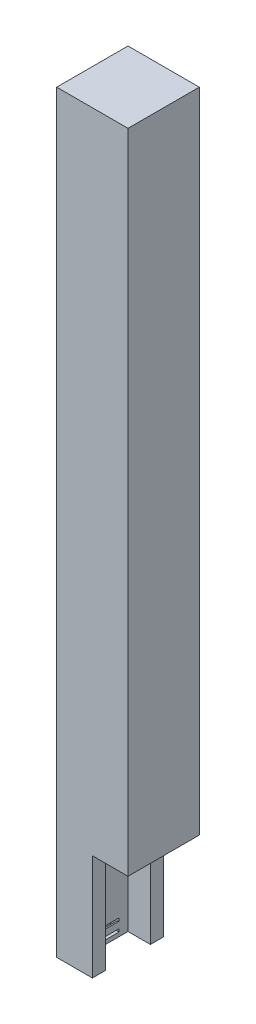
ISO-10303-21;
HEADER;
FILE_DESCRIPTION(('STEP AP214'),'2;1');
FILE_NAME('part.step','',(''),(''),'','','');
FILE_SCHEMA(('AUTOMOTIVE_DESIGN { 1 0 10303 214 1 1 1 1 }'));
ENDSEC;
DATA;
#1=APPLICATION_CONTEXT('core data for automotive mechanical design processes');
#2=APPLICATION_PROTOCOL_DEFINITION('international standard','automotive_design',2000,#1);
#3=PRODUCT_CONTEXT('',#1,'mechanical');
#4=PRODUCT('Part','Part','',(#3));
#5=PRODUCT_RELATED_PRODUCT_CATEGORY('part','',(#4));
#6=PRODUCT_DEFINITION_FORMATION('','',#4);
#7=PRODUCT_DEFINITION_CONTEXT('part definition',#1,'design');
#8=PRODUCT_DEFINITION('design','',#6,#7);
#9=PRODUCT_DEFINITION_SHAPE('','',#8);
#10=(LENGTH_UNIT() NAMED_UNIT(*) SI_UNIT(.MILLI.,.METRE.));
#11=(NAMED_UNIT(*) PLANE_ANGLE_UNIT() SI_UNIT($,.RADIAN.));
#12=(NAMED_UNIT(*) SI_UNIT($,.STERADIAN.) SOLID_ANGLE_UNIT());
#13=UNCERTAINTY_MEASURE_WITH_UNIT(LENGTH_MEASURE(1.E-05),#10,'distance_accuracy_value','');
#14=(GEOMETRIC_REPRESENTATION_CONTEXT(3) GLOBAL_UNCERTAINTY_ASSIGNED_CONTEXT((#13)) GLOBAL_UNIT_ASSIGNED_CONTEXT((#10,
#11,#12)) REPRESENTATION_CONTEXT('',''));
#15=CARTESIAN_POINT('',(0.,0.,0.));
#16=DIRECTION('',(0.,0.,1.));
#17=DIRECTION('',(1.,0.,0.));
#18=AXIS2_PLACEMENT_3D('',#15,#16,#17);
#19=CARTESIAN_POINT('',(-9.525,5.08,-4.191));
#20=DIRECTION('',(0.,0.,-1.));
#21=DIRECTION('',(-1.,0.,0.));
#22=AXIS2_PLACEMENT_3D('',#19,#20,#21);
#23=PLANE('',#22);
#24=CARTESIAN_POINT('',(-6.985,3.175,-4.191));
#25=DIRECTION('',(0.,0.,-1.));
#26=DIRECTION('',(-1.,0.,0.));
#27=AXIS2_PLACEMENT_3D('',#24,#25,#26);
#28=CIRCLE('',#27,1.016);
#29=CARTESIAN_POINT('',(-6.985,2.159,-4.191));
#30=VERTEX_POINT('',#29);
#31=CARTESIAN_POINT('',(-6.985,4.191,-4.191));
#32=VERTEX_POINT('',#31);
#33=EDGE_CURVE('E319',#30,#32,#28,.T.);
#34=ORIENTED_EDGE('',*,*,#33,.T.);
#35=DIRECTION('',(0.,1.,0.));
#36=VECTOR('',#35,1.);
#37=CARTESIAN_POINT('',(-6.985,5.08,-4.191));
#38=LINE('',#37,#36);
#39=CARTESIAN_POINT('',(-6.985,5.08,-4.191));
#40=VERTEX_POINT('',#39);
#41=EDGE_CURVE('E322',#32,#40,#38,.T.);
#42=ORIENTED_EDGE('',*,*,#41,.T.);
#43=DIRECTION('',(1.,0.,0.));
#44=VECTOR('',#43,1.);
#45=CARTESIAN_POINT('',(-9.525,5.08,-4.191));
#46=LINE('',#45,#44);
#47=CARTESIAN_POINT('',(-9.525,5.08,-4.191));
#48=VERTEX_POINT('',#47);
#49=EDGE_CURVE('E346',#48,#40,#46,.T.);
#50=ORIENTED_EDGE('',*,*,#49,.F.);
#51=DIRECTION('',(0.,1.,0.));
#52=VECTOR('',#51,1.);
#53=CARTESIAN_POINT('',(-9.525,5.08,-4.191));
#54=LINE('',#53,#52);
#55=CARTESIAN_POINT('',(-9.525,1.27,-4.191));
#56=VERTEX_POINT('',#55);
#57=EDGE_CURVE('E329',#56,#48,#54,.T.);
#58=ORIENTED_EDGE('',*,*,#57,.F.);
#59=DIRECTION('',(1.,0.,0.));
#60=VECTOR('',#59,1.);
#61=CARTESIAN_POINT('',(-9.525,1.27,-4.191));
#62=LINE('',#61,#60);
#63=CARTESIAN_POINT('',(-6.985,1.27,-4.191));
#64=VERTEX_POINT('',#63);
#65=EDGE_CURVE('E360',#56,#64,#62,.T.);
#66=ORIENTED_EDGE('',*,*,#65,.T.);
#67=EDGE_CURVE('E68',#64,#30,#38,.T.);
#68=ORIENTED_EDGE('',*,*,#67,.T.);
#69=EDGE_LOOP('',(#34,#42,#50,#58,#66,#68));
#70=FACE_BOUND('',#69,.T.);
#71=ADVANCED_FACE('F45',(#70),#23,.F.);
#72=CARTESIAN_POINT('',(-9.525,5.08,4.191));
#73=DIRECTION('',(0.,0.,1.));
#74=DIRECTION('',(1.,0.,0.));
#75=AXIS2_PLACEMENT_3D('',#72,#73,#74);
#76=PLANE('',#75);
#77=CARTESIAN_POINT('',(-6.985,3.175,4.191));
#78=DIRECTION('',(0.,0.,-1.));
#79=DIRECTION('',(-1.,0.,0.));
#80=AXIS2_PLACEMENT_3D('',#77,#78,#79);
#81=CIRCLE('',#80,1.016);
#82=CARTESIAN_POINT('',(-6.985,2.159,4.191));
#83=VERTEX_POINT('',#82);
#84=CARTESIAN_POINT('',(-6.985,4.191,4.191));
#85=VERTEX_POINT('',#84);
#86=EDGE_CURVE('E314',#83,#85,#81,.T.);
#87=ORIENTED_EDGE('',*,*,#86,.F.);
#88=DIRECTION('',(0.,-1.,0.));
#89=VECTOR('',#88,1.);
#90=CARTESIAN_POINT('',(-6.985,5.08,4.191));
#91=LINE('',#90,#89);
#92=CARTESIAN_POINT('',(-6.985,1.27,4.191));
#93=VERTEX_POINT('',#92);
#94=EDGE_CURVE('E353',#83,#93,#91,.T.);
#95=ORIENTED_EDGE('',*,*,#94,.T.);
#96=DIRECTION('',(1.,0.,0.));
#97=VECTOR('',#96,1.);
#98=CARTESIAN_POINT('',(-9.525,1.27,4.191));
#99=LINE('',#98,#97);
#100=CARTESIAN_POINT('',(-9.525,1.27,4.191));
#101=VERTEX_POINT('',#100);
#102=EDGE_CURVE('E364',#101,#93,#99,.T.);
#103=ORIENTED_EDGE('',*,*,#102,.F.);
#104=DIRECTION('',(0.,-1.,0.));
#105=VECTOR('',#104,1.);
#106=CARTESIAN_POINT('',(-9.525,5.08,4.191));
#107=LINE('',#106,#105);
#108=CARTESIAN_POINT('',(-9.525,5.08,4.191));
#109=VERTEX_POINT('',#108);
#110=EDGE_CURVE('E338',#109,#101,#107,.T.);
#111=ORIENTED_EDGE('',*,*,#110,.F.);
#112=DIRECTION('',(1.,0.,0.));
#113=VECTOR('',#112,1.);
#114=CARTESIAN_POINT('',(-9.525,5.08,4.191));
#115=LINE('',#114,#113);
#116=CARTESIAN_POINT('',(-6.985,5.08,4.191));
#117=VERTEX_POINT('',#116);
#118=EDGE_CURVE('E368',#109,#117,#115,.T.);
#119=ORIENTED_EDGE('',*,*,#118,.T.);
#120=EDGE_CURVE('E354',#117,#85,#91,.T.);
#121=ORIENTED_EDGE('',*,*,#120,.T.);
#122=EDGE_LOOP('',(#87,#95,#103,#111,#119,#121));
#123=FACE_BOUND('',#122,.T.);
#124=ADVANCED_FACE('F409',(#123),#76,.F.);
#125=CARTESIAN_POINT('',(0.,0.,0.));
#126=DIRECTION('',(0.,-1.,0.));
#127=DIRECTION('',(0.,0.,-1.));
#128=AXIS2_PLACEMENT_3D('',#125,#126,#127);
#129=PLANE('',#128);
#130=DIRECTION('',(0.,0.,-1.));
#131=VECTOR('',#130,1.);
#132=CARTESIAN_POINT('',(0.,0.,11.1125));
#133=LINE('',#132,#131);
#134=CARTESIAN_POINT('',(0.,0.,11.1125));
#135=VERTEX_POINT('',#134);
#136=CARTESIAN_POINT('',(0.,0.,6.985));
#137=VERTEX_POINT('',#136);
#138=EDGE_CURVE('E180',#135,#137,#133,.T.);
#139=ORIENTED_EDGE('',*,*,#138,.F.);
#140=DIRECTION('',(1.,0.,0.));
#141=VECTOR('',#140,1.);
#142=CARTESIAN_POINT('',(-11.1125,0.,11.1125));
#143=LINE('',#142,#141);
#144=CARTESIAN_POINT('',(-11.1125,0.,11.1125));
#145=VERTEX_POINT('',#144);
#146=EDGE_CURVE('E197',#145,#135,#143,.T.);
#147=ORIENTED_EDGE('',*,*,#146,.F.);
#148=DIRECTION('',(0.,0.,1.));
#149=VECTOR('',#148,1.);
#150=CARTESIAN_POINT('',(-11.1125,0.,11.1125));
#151=LINE('',#150,#149);
#152=CARTESIAN_POINT('',(-11.1125,0.,-11.1125));
#153=VERTEX_POINT('',#152);
#154=EDGE_CURVE('E204',#153,#145,#151,.T.);
#155=ORIENTED_EDGE('',*,*,#154,.F.);
#156=DIRECTION('',(-1.,0.,0.));
#157=VECTOR('',#156,1.);
#158=CARTESIAN_POINT('',(-11.1125,0.,-11.1125));
#159=LINE('',#158,#157);
#160=CARTESIAN_POINT('',(0.,0.,-11.1125));
#161=VERTEX_POINT('',#160);
#162=EDGE_CURVE('E255',#161,#153,#159,.T.);
#163=ORIENTED_EDGE('',*,*,#162,.F.);
#164=CARTESIAN_POINT('',(0.,0.,-6.985));
#165=VERTEX_POINT('',#164);
#166=EDGE_CURVE('E273',#165,#161,#133,.T.);
#167=ORIENTED_EDGE('',*,*,#166,.F.);
#168=DIRECTION('',(-1.,0.,0.));
#169=VECTOR('',#168,1.);
#170=CARTESIAN_POINT('',(-6.985,0.,-6.985));
#171=LINE('',#170,#169);
#172=CARTESIAN_POINT('',(-6.985,0.,-6.985));
#173=VERTEX_POINT('',#172);
#174=EDGE_CURVE('E363',#165,#173,#171,.T.);
#175=ORIENTED_EDGE('',*,*,#174,.T.);
#176=DIRECTION('',(0.,0.,1.));
#177=VECTOR('',#176,1.);
#178=CARTESIAN_POINT('',(-6.985,0.,6.985));
#179=LINE('',#178,#177);
#180=CARTESIAN_POINT('',(-6.985,0.,6.985));
#181=VERTEX_POINT('',#180);
#182=EDGE_CURVE('E246',#173,#181,#179,.T.);
#183=ORIENTED_EDGE('',*,*,#182,.T.);
#184=DIRECTION('',(1.,0.,0.));
#185=VECTOR('',#184,1.);
#186=CARTESIAN_POINT('',(-6.985,0.,6.985));
#187=LINE('',#186,#185);
#188=EDGE_CURVE('E239',#181,#137,#187,.T.);
#189=ORIENTED_EDGE('',*,*,#188,.T.);
#190=EDGE_LOOP('',(#139,#147,#155,#163,#167,#175,#183,#189));
#191=FACE_BOUND('',#190,.T.);
#192=ADVANCED_FACE('F268',(#191),#129,.T.);
#193=CARTESIAN_POINT('',(11.1125,6.35,11.1125));
#194=DIRECTION('',(-1.,0.,0.));
#195=DIRECTION('',(0.,0.,1.));
#196=AXIS2_PLACEMENT_3D('',#193,#194,#195);
#197=PLANE('',#196);
#198=DIRECTION('',(0.,-1.,0.));
#199=VECTOR('',#198,1.);
#200=CARTESIAN_POINT('',(11.1125,6.35,11.1125));
#201=LINE('',#200,#199);
#202=CARTESIAN_POINT('',(11.1125,234.95,11.1125));
#203=VERTEX_POINT('',#202);
#204=CARTESIAN_POINT('',(11.1125,33.02,11.1125));
#205=VERTEX_POINT('',#204);
#206=EDGE_CURVE('E186',#203,#205,#201,.T.);
#207=ORIENTED_EDGE('',*,*,#206,.T.);
#208=DIRECTION('',(0.,0.,1.));
#209=VECTOR('',#208,1.);
#210=CARTESIAN_POINT('',(11.1125,33.02,11.1125));
#211=LINE('',#210,#209);
#212=CARTESIAN_POINT('',(11.1125,33.02,-11.1125));
#213=VERTEX_POINT('',#212);
#214=EDGE_CURVE('E169',#213,#205,#211,.T.);
#215=ORIENTED_EDGE('',*,*,#214,.F.);
#216=DIRECTION('',(0.,-1.,0.));
#217=VECTOR('',#216,1.);
#218=CARTESIAN_POINT('',(11.1125,6.35,-11.1125));
#219=LINE('',#218,#217);
#220=CARTESIAN_POINT('',(11.1125,234.95,-11.1125));
#221=VERTEX_POINT('',#220);
#222=EDGE_CURVE('E211',#221,#213,#219,.T.);
#223=ORIENTED_EDGE('',*,*,#222,.F.);
#224=DIRECTION('',(0.,0.,-1.));
#225=VECTOR('',#224,1.);
#226=CARTESIAN_POINT('',(11.1125,234.95,11.1125));
#227=LINE('',#226,#225);
#228=EDGE_CURVE('E194',#203,#221,#227,.T.);
#229=ORIENTED_EDGE('',*,*,#228,.F.);
#230=EDGE_LOOP('',(#207,#215,#223,#229));
#231=FACE_BOUND('',#230,.T.);
#232=ADVANCED_FACE('F47',(#231),#197,.F.);
#233=CARTESIAN_POINT('',(-11.1125,6.35,-11.1125));
#234=DIRECTION('',(0.,0.,1.));
#235=DIRECTION('',(1.,0.,0.));
#236=AXIS2_PLACEMENT_3D('',#233,#234,#235);
#237=PLANE('',#236);
#238=DIRECTION('',(1.,0.,0.));
#239=VECTOR('',#238,1.);
#240=CARTESIAN_POINT('',(11.1125,33.02,-11.1125));
#241=LINE('',#240,#239);
#242=CARTESIAN_POINT('',(0.,33.02,-11.1125));
#243=VERTEX_POINT('',#242);
#244=EDGE_CURVE('E175',#243,#213,#241,.T.);
#245=ORIENTED_EDGE('',*,*,#244,.F.);
#246=DIRECTION('',(0.,-1.,0.));
#247=VECTOR('',#246,1.);
#248=CARTESIAN_POINT('',(0.,33.02,-11.1125));
#249=LINE('',#248,#247);
#250=EDGE_CURVE('E232',#243,#161,#249,.T.);
#251=ORIENTED_EDGE('',*,*,#250,.T.);
#252=ORIENTED_EDGE('',*,*,#162,.T.);
#253=DIRECTION('',(0.,-1.,0.));
#254=VECTOR('',#253,1.);
#255=CARTESIAN_POINT('',(-11.1125,6.35,-11.1125));
#256=LINE('',#255,#254);
#257=CARTESIAN_POINT('',(-11.1125,234.95,-11.1125));
#258=VERTEX_POINT('',#257);
#259=EDGE_CURVE('E202',#258,#153,#256,.T.);
#260=ORIENTED_EDGE('',*,*,#259,.F.);
#261=DIRECTION('',(-1.,0.,0.));
#262=VECTOR('',#261,1.);
#263=CARTESIAN_POINT('',(-11.1125,234.95,-11.1125));
#264=LINE('',#263,#262);
#265=EDGE_CURVE('E291',#221,#258,#264,.T.);
#266=ORIENTED_EDGE('',*,*,#265,.F.);
#267=ORIENTED_EDGE('',*,*,#222,.T.);
#268=EDGE_LOOP('',(#245,#251,#252,#260,#266,#267));
#269=FACE_BOUND('',#268,.T.);
#270=ADVANCED_FACE('F392',(#269),#237,.F.);
#271=CARTESIAN_POINT('',(-11.1125,6.35,11.1125));
#272=DIRECTION('',(1.,0.,0.));
#273=DIRECTION('',(0.,0.,-1.));
#274=AXIS2_PLACEMENT_3D('',#271,#272,#273);
#275=PLANE('',#274);
#276=ORIENTED_EDGE('',*,*,#154,.T.);
#277=DIRECTION('',(0.,-1.,0.));
#278=VECTOR('',#277,1.);
#279=CARTESIAN_POINT('',(-11.1125,6.35,11.1125));
#280=LINE('',#279,#278);
#281=CARTESIAN_POINT('',(-11.1125,234.95,11.1125));
#282=VERTEX_POINT('',#281);
#283=EDGE_CURVE('E196',#282,#145,#280,.T.);
#284=ORIENTED_EDGE('',*,*,#283,.F.);
#285=DIRECTION('',(0.,0.,1.));
#286=VECTOR('',#285,1.);
#287=CARTESIAN_POINT('',(-11.1125,234.95,11.1125));
#288=LINE('',#287,#286);
#289=EDGE_CURVE('E295',#258,#282,#288,.T.);
#290=ORIENTED_EDGE('',*,*,#289,.F.);
#291=ORIENTED_EDGE('',*,*,#259,.T.);
#292=EDGE_LOOP('',(#276,#284,#290,#291));
#293=FACE_BOUND('',#292,.T.);
#294=ADVANCED_FACE('F260',(#293),#275,.F.);
#295=CARTESIAN_POINT('',(-11.1125,6.35,11.1125));
#296=DIRECTION('',(0.,0.,-1.));
#297=DIRECTION('',(-1.,0.,0.));
#298=AXIS2_PLACEMENT_3D('',#295,#296,#297);
#299=PLANE('',#298);
#300=ORIENTED_EDGE('',*,*,#146,.T.);
#301=DIRECTION('',(0.,-1.,0.));
#302=VECTOR('',#301,1.);
#303=CARTESIAN_POINT('',(0.,33.02,11.1125));
#304=LINE('',#303,#302);
#305=CARTESIAN_POINT('',(0.,33.02,11.1125));
#306=VERTEX_POINT('',#305);
#307=EDGE_CURVE('E188',#306,#135,#304,.T.);
#308=ORIENTED_EDGE('',*,*,#307,.F.);
#309=DIRECTION('',(-1.,0.,0.));
#310=VECTOR('',#309,1.);
#311=CARTESIAN_POINT('',(11.1125,33.02,11.1125));
#312=LINE('',#311,#310);
#313=EDGE_CURVE('E172',#205,#306,#312,.T.);
#314=ORIENTED_EDGE('',*,*,#313,.F.);
#315=ORIENTED_EDGE('',*,*,#206,.F.);
#316=DIRECTION('',(1.,0.,0.));
#317=VECTOR('',#316,1.);
#318=CARTESIAN_POINT('',(-11.1125,234.95,11.1125));
#319=LINE('',#318,#317);
#320=EDGE_CURVE('E266',#282,#203,#319,.T.);
#321=ORIENTED_EDGE('',*,*,#320,.F.);
#322=ORIENTED_EDGE('',*,*,#283,.T.);
#323=EDGE_LOOP('',(#300,#308,#314,#315,#321,#322));
#324=FACE_BOUND('',#323,.T.);
#325=ADVANCED_FACE('F184',(#324),#299,.F.);
#326=CARTESIAN_POINT('',(6.985,6.35,6.985));
#327=DIRECTION('',(-1.,0.,0.));
#328=DIRECTION('',(0.,0.,1.));
#329=AXIS2_PLACEMENT_3D('',#326,#327,#328);
#330=PLANE('',#329);
#331=DIRECTION('',(0.,0.,-1.));
#332=VECTOR('',#331,1.);
#333=CARTESIAN_POINT('',(6.985,33.02,6.985));
#334=LINE('',#333,#332);
#335=CARTESIAN_POINT('',(6.985,33.02,6.985));
#336=VERTEX_POINT('',#335);
#337=CARTESIAN_POINT('',(6.985,33.02,-6.985));
#338=VERTEX_POINT('',#337);
#339=EDGE_CURVE('E216',#336,#338,#334,.T.);
#340=ORIENTED_EDGE('',*,*,#339,.F.);
#341=DIRECTION('',(0.,-1.,0.));
#342=VECTOR('',#341,1.);
#343=CARTESIAN_POINT('',(6.985,6.35,6.985));
#344=LINE('',#343,#342);
#345=CARTESIAN_POINT('',(6.985,228.6,6.985));
#346=VERTEX_POINT('',#345);
#347=EDGE_CURVE('E226',#346,#336,#344,.T.);
#348=ORIENTED_EDGE('',*,*,#347,.F.);
#349=DIRECTION('',(0.,0.,-1.));
#350=VECTOR('',#349,1.);
#351=CARTESIAN_POINT('',(6.985,228.6,6.985));
#352=LINE('',#351,#350);
#353=CARTESIAN_POINT('',(6.985,228.6,-6.98499999999999));
#354=VERTEX_POINT('',#353);
#355=EDGE_CURVE('E300',#346,#354,#352,.T.);
#356=ORIENTED_EDGE('',*,*,#355,.T.);
#357=DIRECTION('',(0.,-1.,0.));
#358=VECTOR('',#357,1.);
#359=CARTESIAN_POINT('',(6.985,6.35,-6.985));
#360=LINE('',#359,#358);
#361=EDGE_CURVE('E229',#354,#338,#360,.T.);
#362=ORIENTED_EDGE('',*,*,#361,.T.);
#363=EDGE_LOOP('',(#340,#348,#356,#362));
#364=FACE_BOUND('',#363,.T.);
#365=ADVANCED_FACE('F224',(#364),#330,.T.);
#366=CARTESIAN_POINT('',(-6.985,6.35,-6.985));
#367=DIRECTION('',(0.,0.,1.));
#368=DIRECTION('',(1.,0.,0.));
#369=AXIS2_PLACEMENT_3D('',#366,#367,#368);
#370=PLANE('',#369);
#371=DIRECTION('',(0.,-1.,0.));
#372=VECTOR('',#371,1.);
#373=CARTESIAN_POINT('',(0.,6.35,-6.985));
#374=LINE('',#373,#372);
#375=CARTESIAN_POINT('',(0.,33.02,-6.985));
#376=VERTEX_POINT('',#375);
#377=EDGE_CURVE('E286',#376,#165,#374,.T.);
#378=ORIENTED_EDGE('',*,*,#377,.F.);
#379=DIRECTION('',(-1.,0.,0.));
#380=VECTOR('',#379,1.);
#381=CARTESIAN_POINT('',(-6.985,33.02,-6.985));
#382=LINE('',#381,#380);
#383=EDGE_CURVE('E231',#338,#376,#382,.T.);
#384=ORIENTED_EDGE('',*,*,#383,.F.);
#385=ORIENTED_EDGE('',*,*,#361,.F.);
#386=DIRECTION('',(-1.,0.,0.));
#387=VECTOR('',#386,1.);
#388=CARTESIAN_POINT('',(-6.98499999999999,228.6,-6.98499999999999));
#389=LINE('',#388,#387);
#390=CARTESIAN_POINT('',(-6.98499999999999,228.6,-6.98499999999999));
#391=VERTEX_POINT('',#390);
#392=EDGE_CURVE('E303',#354,#391,#389,.T.);
#393=ORIENTED_EDGE('',*,*,#392,.T.);
#394=DIRECTION('',(0.,-1.,0.));
#395=VECTOR('',#394,1.);
#396=CARTESIAN_POINT('',(-6.985,6.35,-6.985));
#397=LINE('',#396,#395);
#398=EDGE_CURVE('E243',#391,#173,#397,.T.);
#399=ORIENTED_EDGE('',*,*,#398,.T.);
#400=ORIENTED_EDGE('',*,*,#174,.F.);
#401=EDGE_LOOP('',(#378,#384,#385,#393,#399,#400));
#402=FACE_BOUND('',#401,.T.);
#403=ADVANCED_FACE('F425',(#402),#370,.T.);
#404=CARTESIAN_POINT('',(-6.985,6.35,6.985));
#405=DIRECTION('',(1.,0.,0.));
#406=DIRECTION('',(0.,0.,-1.));
#407=AXIS2_PLACEMENT_3D('',#404,#405,#406);
#408=PLANE('',#407);
#409=DIRECTION('',(0.,0.,1.));
#410=VECTOR('',#409,1.);
#411=CARTESIAN_POINT('',(-6.985,2.159,-6.46284506513979));
#412=LINE('',#411,#410);
#413=EDGE_CURVE('E313',#30,#83,#412,.T.);
#414=ORIENTED_EDGE('',*,*,#413,.F.);
#415=ORIENTED_EDGE('',*,*,#67,.F.);
#416=DIRECTION('',(0.,0.,-1.));
#417=VECTOR('',#416,1.);
#418=CARTESIAN_POINT('',(-6.985,1.27,4.191));
#419=LINE('',#418,#417);
#420=EDGE_CURVE('E334',#93,#64,#419,.T.);
#421=ORIENTED_EDGE('',*,*,#420,.F.);
#422=ORIENTED_EDGE('',*,*,#94,.F.);
#423=EDGE_LOOP('',(#414,#415,#421,#422));
#424=FACE_BOUND('',#423,.T.);
#425=ORIENTED_EDGE('',*,*,#41,.F.);
#426=DIRECTION('',(0.,0.,1.));
#427=VECTOR('',#426,1.);
#428=CARTESIAN_POINT('',(-6.985,4.191,-6.46284506513979));
#429=LINE('',#428,#427);
#430=EDGE_CURVE('E318',#32,#85,#429,.T.);
#431=ORIENTED_EDGE('',*,*,#430,.T.);
#432=ORIENTED_EDGE('',*,*,#120,.F.);
#433=DIRECTION('',(0.,0.,1.));
#434=VECTOR('',#433,1.);
#435=CARTESIAN_POINT('',(-6.985,5.08,4.191));
#436=LINE('',#435,#434);
#437=EDGE_CURVE('E349',#40,#117,#436,.T.);
#438=ORIENTED_EDGE('',*,*,#437,.F.);
#439=EDGE_LOOP('',(#425,#431,#432,#438));
#440=FACE_BOUND('',#439,.T.);
#441=ORIENTED_EDGE('',*,*,#182,.F.);
#442=ORIENTED_EDGE('',*,*,#398,.F.);
#443=DIRECTION('',(0.,0.,1.));
#444=VECTOR('',#443,1.);
#445=CARTESIAN_POINT('',(-6.98499999999999,228.6,6.985));
#446=LINE('',#445,#444);
#447=CARTESIAN_POINT('',(-6.98499999999999,228.6,6.985));
#448=VERTEX_POINT('',#447);
#449=EDGE_CURVE('E307',#391,#448,#446,.T.);
#450=ORIENTED_EDGE('',*,*,#449,.T.);
#451=DIRECTION('',(0.,-1.,0.));
#452=VECTOR('',#451,1.);
#453=CARTESIAN_POINT('',(-6.985,6.35,6.985));
#454=LINE('',#453,#452);
#455=EDGE_CURVE('E238',#448,#181,#454,.T.);
#456=ORIENTED_EDGE('',*,*,#455,.T.);
#457=EDGE_LOOP('',(#441,#442,#450,#456));
#458=FACE_BOUND('',#457,.T.);
#459=ADVANCED_FACE('F381',(#424,#440,#458),#408,.T.);
#460=CARTESIAN_POINT('',(-6.985,6.35,6.985));
#461=DIRECTION('',(0.,0.,-1.));
#462=DIRECTION('',(-1.,0.,0.));
#463=AXIS2_PLACEMENT_3D('',#460,#461,#462);
#464=PLANE('',#463);
#465=DIRECTION('',(0.,1.,0.));
#466=VECTOR('',#465,1.);
#467=CARTESIAN_POINT('',(0.,6.35,6.985));
#468=LINE('',#467,#466);
#469=CARTESIAN_POINT('',(0.,33.02,6.985));
#470=VERTEX_POINT('',#469);
#471=EDGE_CURVE('E11',#137,#470,#468,.T.);
#472=ORIENTED_EDGE('',*,*,#471,.F.);
#473=ORIENTED_EDGE('',*,*,#188,.F.);
#474=ORIENTED_EDGE('',*,*,#455,.F.);
#475=DIRECTION('',(1.,0.,0.));
#476=VECTOR('',#475,1.);
#477=CARTESIAN_POINT('',(-6.98499999999999,228.6,6.985));
#478=LINE('',#477,#476);
#479=EDGE_CURVE('E236',#448,#346,#478,.T.);
#480=ORIENTED_EDGE('',*,*,#479,.T.);
#481=ORIENTED_EDGE('',*,*,#347,.T.);
#482=DIRECTION('',(1.,0.,0.));
#483=VECTOR('',#482,1.);
#484=CARTESIAN_POINT('',(-6.985,33.02,6.985));
#485=LINE('',#484,#483);
#486=EDGE_CURVE('E54',#470,#336,#485,.T.);
#487=ORIENTED_EDGE('',*,*,#486,.F.);
#488=EDGE_LOOP('',(#472,#473,#474,#480,#481,#487));
#489=FACE_BOUND('',#488,.T.);
#490=ADVANCED_FACE('F234',(#489),#464,.T.);
#491=CARTESIAN_POINT('',(-9.525,1.27,4.191));
#492=DIRECTION('',(0.,-1.,0.));
#493=DIRECTION('',(0.,0.,-1.));
#494=AXIS2_PLACEMENT_3D('',#491,#492,#493);
#495=PLANE('',#494);
#496=ORIENTED_EDGE('',*,*,#420,.T.);
#497=ORIENTED_EDGE('',*,*,#65,.F.);
#498=DIRECTION('',(0.,0.,-1.));
#499=VECTOR('',#498,1.);
#500=CARTESIAN_POINT('',(-9.525,1.27,4.191));
#501=LINE('',#500,#499);
#502=EDGE_CURVE('E342',#101,#56,#501,.T.);
#503=ORIENTED_EDGE('',*,*,#502,.F.);
#504=ORIENTED_EDGE('',*,*,#102,.T.);
#505=EDGE_LOOP('',(#496,#497,#503,#504));
#506=FACE_BOUND('',#505,.T.);
#507=ADVANCED_FACE('F422',(#506),#495,.F.);
#508=CARTESIAN_POINT('',(-9.525,5.08,4.191));
#509=DIRECTION('',(0.,1.,0.));
#510=DIRECTION('',(0.,0.,1.));
#511=AXIS2_PLACEMENT_3D('',#508,#509,#510);
#512=PLANE('',#511);
#513=ORIENTED_EDGE('',*,*,#437,.T.);
#514=ORIENTED_EDGE('',*,*,#118,.F.);
#515=DIRECTION('',(0.,0.,1.));
#516=VECTOR('',#515,1.);
#517=CARTESIAN_POINT('',(-9.525,5.08,4.191));
#518=LINE('',#517,#516);
#519=EDGE_CURVE('E333',#48,#109,#518,.T.);
#520=ORIENTED_EDGE('',*,*,#519,.F.);
#521=ORIENTED_EDGE('',*,*,#49,.T.);
#522=EDGE_LOOP('',(#513,#514,#520,#521));
#523=FACE_BOUND('',#522,.T.);
#524=ADVANCED_FACE('F419',(#523),#512,.F.);
#525=CARTESIAN_POINT('',(-9.525,0.,0.));
#526=DIRECTION('',(1.,0.,0.));
#527=DIRECTION('',(0.,0.,-1.));
#528=AXIS2_PLACEMENT_3D('',#525,#526,#527);
#529=PLANE('',#528);
#530=ORIENTED_EDGE('',*,*,#57,.T.);
#531=ORIENTED_EDGE('',*,*,#519,.T.);
#532=ORIENTED_EDGE('',*,*,#110,.T.);
#533=ORIENTED_EDGE('',*,*,#502,.T.);
#534=EDGE_LOOP('',(#530,#531,#532,#533));
#535=FACE_BOUND('',#534,.T.);
#536=ADVANCED_FACE('F534',(#535),#529,.T.);
#537=CARTESIAN_POINT('',(-6.985,3.175,-6.46284506513979));
#538=DIRECTION('',(0.,0.,1.));
#539=DIRECTION('',(1.,0.,0.));
#540=AXIS2_PLACEMENT_3D('',#537,#538,#539);
#541=CYLINDRICAL_SURFACE('',#540,1.016);
#542=ORIENTED_EDGE('',*,*,#33,.F.);
#543=ORIENTED_EDGE('',*,*,#413,.T.);
#544=ORIENTED_EDGE('',*,*,#86,.T.);
#545=ORIENTED_EDGE('',*,*,#430,.F.);
#546=EDGE_LOOP('',(#542,#543,#544,#545));
#547=FACE_BOUND('',#546,.T.);
#548=ADVANCED_FACE('F405',(#547),#541,.T.);
#549=CARTESIAN_POINT('',(0.,228.6,0.));
#550=DIRECTION('',(0.,-1.,0.));
#551=DIRECTION('',(0.,0.,-1.));
#552=AXIS2_PLACEMENT_3D('',#549,#550,#551);
#553=PLANE('',#552);
#554=ORIENTED_EDGE('',*,*,#355,.F.);
#555=ORIENTED_EDGE('',*,*,#479,.F.);
#556=ORIENTED_EDGE('',*,*,#449,.F.);
#557=ORIENTED_EDGE('',*,*,#392,.F.);
#558=EDGE_LOOP('',(#554,#555,#556,#557));
#559=FACE_BOUND('',#558,.T.);
#560=ADVANCED_FACE('F397',(#559),#553,.T.);
#561=CARTESIAN_POINT('',(0.,234.95,0.));
#562=DIRECTION('',(0.,-1.,0.));
#563=DIRECTION('',(0.,0.,-1.));
#564=AXIS2_PLACEMENT_3D('',#561,#562,#563);
#565=PLANE('',#564);
#566=ORIENTED_EDGE('',*,*,#228,.T.);
#567=ORIENTED_EDGE('',*,*,#265,.T.);
#568=ORIENTED_EDGE('',*,*,#289,.T.);
#569=ORIENTED_EDGE('',*,*,#320,.T.);
#570=EDGE_LOOP('',(#566,#567,#568,#569));
#571=FACE_BOUND('',#570,.T.);
#572=ADVANCED_FACE('F395',(#571),#565,.F.);
#573=CARTESIAN_POINT('',(0.,33.02,11.1125));
#574=DIRECTION('',(-1.,0.,0.));
#575=DIRECTION('',(0.,0.,1.));
#576=AXIS2_PLACEMENT_3D('',#573,#574,#575);
#577=PLANE('',#576);
#578=ORIENTED_EDGE('',*,*,#377,.T.);
#579=ORIENTED_EDGE('',*,*,#166,.T.);
#580=ORIENTED_EDGE('',*,*,#250,.F.);
#581=DIRECTION('',(0.,0.,-1.));
#582=VECTOR('',#581,1.);
#583=CARTESIAN_POINT('',(0.,33.02,11.1125));
#584=LINE('',#583,#582);
#585=EDGE_CURVE('E190',#376,#243,#584,.T.);
#586=ORIENTED_EDGE('',*,*,#585,.F.);
#587=EDGE_LOOP('',(#578,#579,#580,#586));
#588=FACE_BOUND('',#587,.T.);
#589=ADVANCED_FACE('F390',(#588),#577,.F.);
#590=ORIENTED_EDGE('',*,*,#471,.T.);
#591=EDGE_CURVE('E61',#306,#470,#584,.T.);
#592=ORIENTED_EDGE('',*,*,#591,.F.);
#593=ORIENTED_EDGE('',*,*,#307,.T.);
#594=ORIENTED_EDGE('',*,*,#138,.T.);
#595=EDGE_LOOP('',(#590,#592,#593,#594));
#596=FACE_BOUND('',#595,.T.);
#597=ADVANCED_FACE('F382',(#596),#577,.F.);
#598=CARTESIAN_POINT('',(0.,33.02,0.));
#599=DIRECTION('',(0.,1.,0.));
#600=DIRECTION('',(0.,0.,1.));
#601=AXIS2_PLACEMENT_3D('',#598,#599,#600);
#602=PLANE('',#601);
#603=ORIENTED_EDGE('',*,*,#383,.T.);
#604=ORIENTED_EDGE('',*,*,#585,.T.);
#605=ORIENTED_EDGE('',*,*,#244,.T.);
#606=ORIENTED_EDGE('',*,*,#214,.T.);
#607=ORIENTED_EDGE('',*,*,#313,.T.);
#608=ORIENTED_EDGE('',*,*,#591,.T.);
#609=ORIENTED_EDGE('',*,*,#486,.T.);
#610=ORIENTED_EDGE('',*,*,#339,.T.);
#611=EDGE_LOOP('',(#603,#604,#605,#606,#607,#608,#609,#610));
#612=FACE_BOUND('',#611,.T.);
#613=ADVANCED_FACE('F171',(#612),#602,.F.);
#614=CLOSED_SHELL('',(#71,#124,#192,#232,#270,#294,#325,#365,#403,#459,#490,#507,#524,#536,#548,
#560,#572,#589,#597,#613));
#615=MANIFOLD_SOLID_BREP('B2',#614);
#616=ADVANCED_BREP_SHAPE_REPRESENTATION('',(#18,#615),#14);
#617=SHAPE_DEFINITION_REPRESENTATION(#9,#616);
ENDSEC;
END-ISO-10303-21;
